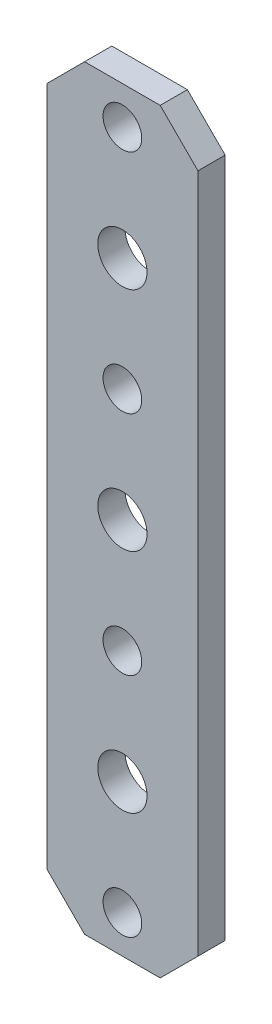
ISO-10303-21;
HEADER;
FILE_DESCRIPTION(('STEP AP214'),'2;1');
FILE_NAME('part.step','',(''),(''),'','','');
FILE_SCHEMA(('AUTOMOTIVE_DESIGN { 1 0 10303 214 1 1 1 1 }'));
ENDSEC;
DATA;
#1=APPLICATION_CONTEXT('core data for automotive mechanical design processes');
#2=APPLICATION_PROTOCOL_DEFINITION('international standard','automotive_design',2000,#1);
#3=PRODUCT_CONTEXT('',#1,'mechanical');
#4=PRODUCT('Part','Part','',(#3));
#5=PRODUCT_RELATED_PRODUCT_CATEGORY('part','',(#4));
#6=PRODUCT_DEFINITION_FORMATION('','',#4);
#7=PRODUCT_DEFINITION_CONTEXT('part definition',#1,'design');
#8=PRODUCT_DEFINITION('design','',#6,#7);
#9=PRODUCT_DEFINITION_SHAPE('','',#8);
#10=(LENGTH_UNIT() NAMED_UNIT(*) SI_UNIT(.MILLI.,.METRE.));
#11=(NAMED_UNIT(*) PLANE_ANGLE_UNIT() SI_UNIT($,.RADIAN.));
#12=(NAMED_UNIT(*) SI_UNIT($,.STERADIAN.) SOLID_ANGLE_UNIT());
#13=UNCERTAINTY_MEASURE_WITH_UNIT(LENGTH_MEASURE(1.E-05),#10,'distance_accuracy_value','');
#14=(GEOMETRIC_REPRESENTATION_CONTEXT(3) GLOBAL_UNCERTAINTY_ASSIGNED_CONTEXT((#13)) GLOBAL_UNIT_ASSIGNED_CONTEXT((#10,
#11,#12)) REPRESENTATION_CONTEXT('',''));
#15=CARTESIAN_POINT('',(0.,0.,0.));
#16=DIRECTION('',(0.,0.,1.));
#17=DIRECTION('',(1.,0.,0.));
#18=AXIS2_PLACEMENT_3D('',#15,#16,#17);
#19=CARTESIAN_POINT('',(-6.35,-31.75,2.286));
#20=DIRECTION('',(0.,0.,1.));
#21=DIRECTION('',(1.,0.,0.));
#22=AXIS2_PLACEMENT_3D('',#19,#20,#21);
#23=PLANE('',#22);
#24=CARTESIAN_POINT('',(0.,28.575,2.286));
#25=DIRECTION('',(0.,0.,-1.));
#26=DIRECTION('',(-1.,0.,0.));
#27=AXIS2_PLACEMENT_3D('',#24,#25,#26);
#28=CIRCLE('',#27,1.6256);
#29=CARTESIAN_POINT('',(-1.6256,28.575,2.286));
#30=VERTEX_POINT('',#29);
#31=EDGE_CURVE('E124',#30,#30,#28,.T.);
#32=ORIENTED_EDGE('',*,*,#31,.T.);
#33=EDGE_LOOP('',(#32));
#34=FACE_BOUND('',#33,.T.);
#35=CARTESIAN_POINT('',(0.,-19.05,2.286));
#36=DIRECTION('',(0.,0.,-1.));
#37=DIRECTION('',(-1.,0.,0.));
#38=AXIS2_PLACEMENT_3D('',#35,#36,#37);
#39=CIRCLE('',#38,2.0701);
#40=CARTESIAN_POINT('',(-2.07009999999999,-19.05,2.286));
#41=VERTEX_POINT('',#40);
#42=EDGE_CURVE('E127',#41,#41,#39,.T.);
#43=ORIENTED_EDGE('',*,*,#42,.T.);
#44=EDGE_LOOP('',(#43));
#45=FACE_BOUND('',#44,.T.);
#46=CARTESIAN_POINT('',(0.,19.05,2.286));
#47=DIRECTION('',(0.,0.,-1.));
#48=DIRECTION('',(-1.,0.,0.));
#49=AXIS2_PLACEMENT_3D('',#46,#47,#48);
#50=CIRCLE('',#49,2.0701);
#51=CARTESIAN_POINT('',(-2.07009999999999,19.05,2.286));
#52=VERTEX_POINT('',#51);
#53=EDGE_CURVE('E130',#52,#52,#50,.T.);
#54=ORIENTED_EDGE('',*,*,#53,.T.);
#55=EDGE_LOOP('',(#54));
#56=FACE_BOUND('',#55,.T.);
#57=CARTESIAN_POINT('',(0.,0.,2.286));
#58=DIRECTION('',(0.,0.,-1.));
#59=DIRECTION('',(-1.,0.,0.));
#60=AXIS2_PLACEMENT_3D('',#57,#58,#59);
#61=CIRCLE('',#60,2.0701);
#62=CARTESIAN_POINT('',(-2.07009999999999,0.,2.286));
#63=VERTEX_POINT('',#62);
#64=EDGE_CURVE('E133',#63,#63,#61,.T.);
#65=ORIENTED_EDGE('',*,*,#64,.T.);
#66=EDGE_LOOP('',(#65));
#67=FACE_BOUND('',#66,.T.);
#68=DIRECTION('',(1.,0.,0.));
#69=VECTOR('',#68,1.);
#70=CARTESIAN_POINT('',(-6.35,31.75,2.286));
#71=LINE('',#70,#69);
#72=CARTESIAN_POINT('',(3.17499999999999,31.75,2.286));
#73=VERTEX_POINT('',#72);
#74=CARTESIAN_POINT('',(-3.175,31.75,2.286));
#75=VERTEX_POINT('',#74);
#76=EDGE_CURVE('E365',#73,#75,#71,.F.);
#77=ORIENTED_EDGE('',*,*,#76,.T.);
#78=DIRECTION('',(0.707106781186547,0.707106781186548,0.));
#79=VECTOR('',#78,1.);
#80=CARTESIAN_POINT('',(-6.35,28.575,2.286));
#81=LINE('',#80,#79);
#82=CARTESIAN_POINT('',(-6.34999999999999,28.575,2.286));
#83=VERTEX_POINT('',#82);
#84=EDGE_CURVE('E360',#75,#83,#81,.F.);
#85=ORIENTED_EDGE('',*,*,#84,.T.);
#86=DIRECTION('',(0.,1.,0.));
#87=VECTOR('',#86,1.);
#88=CARTESIAN_POINT('',(-6.35,31.75,2.286));
#89=LINE('',#88,#87);
#90=CARTESIAN_POINT('',(-6.35,-28.575,2.286));
#91=VERTEX_POINT('',#90);
#92=EDGE_CURVE('E355',#83,#91,#89,.F.);
#93=ORIENTED_EDGE('',*,*,#92,.T.);
#94=DIRECTION('',(-0.707106781186548,0.707106781186547,0.));
#95=VECTOR('',#94,1.);
#96=CARTESIAN_POINT('',(-3.175,-31.75,2.286));
#97=LINE('',#96,#95);
#98=CARTESIAN_POINT('',(-3.175,-31.75,2.286));
#99=VERTEX_POINT('',#98);
#100=EDGE_CURVE('E350',#91,#99,#97,.F.);
#101=ORIENTED_EDGE('',*,*,#100,.T.);
#102=DIRECTION('',(1.,0.,0.));
#103=VECTOR('',#102,1.);
#104=CARTESIAN_POINT('',(-6.35,-31.75,2.286));
#105=LINE('',#104,#103);
#106=CARTESIAN_POINT('',(3.175,-31.75,2.286));
#107=VERTEX_POINT('',#106);
#108=EDGE_CURVE('E85',#99,#107,#105,.T.);
#109=ORIENTED_EDGE('',*,*,#108,.T.);
#110=DIRECTION('',(-0.707106781186548,-0.707106781186547,0.));
#111=VECTOR('',#110,1.);
#112=CARTESIAN_POINT('',(6.35,-28.575,2.286));
#113=LINE('',#112,#111);
#114=CARTESIAN_POINT('',(6.35,-28.575,2.286));
#115=VERTEX_POINT('',#114);
#116=EDGE_CURVE('E83',#107,#115,#113,.F.);
#117=ORIENTED_EDGE('',*,*,#116,.T.);
#118=DIRECTION('',(0.,1.,0.));
#119=VECTOR('',#118,1.);
#120=CARTESIAN_POINT('',(6.35,31.75,2.286));
#121=LINE('',#120,#119);
#122=CARTESIAN_POINT('',(6.35,28.575,2.286));
#123=VERTEX_POINT('',#122);
#124=EDGE_CURVE('E80',#115,#123,#121,.T.);
#125=ORIENTED_EDGE('',*,*,#124,.T.);
#126=DIRECTION('',(0.707106781186548,-0.707106781186548,0.));
#127=VECTOR('',#126,1.);
#128=CARTESIAN_POINT('',(3.175,31.75,2.286));
#129=LINE('',#128,#127);
#130=EDGE_CURVE('E333',#123,#73,#129,.F.);
#131=ORIENTED_EDGE('',*,*,#130,.T.);
#132=EDGE_LOOP('',(#77,#85,#93,#101,#109,#117,#125,#131));
#133=FACE_BOUND('',#132,.T.);
#134=CARTESIAN_POINT('',(0.,9.525,2.286));
#135=DIRECTION('',(0.,0.,-1.));
#136=DIRECTION('',(-1.,0.,0.));
#137=AXIS2_PLACEMENT_3D('',#134,#135,#136);
#138=CIRCLE('',#137,1.6256);
#139=CARTESIAN_POINT('',(-1.62559999999999,9.525,2.286));
#140=VERTEX_POINT('',#139);
#141=EDGE_CURVE('E91',#140,#140,#138,.T.);
#142=ORIENTED_EDGE('',*,*,#141,.T.);
#143=EDGE_LOOP('',(#142));
#144=FACE_BOUND('',#143,.T.);
#145=CARTESIAN_POINT('',(0.,-9.525,2.286));
#146=DIRECTION('',(0.,0.,-1.));
#147=DIRECTION('',(-1.,0.,0.));
#148=AXIS2_PLACEMENT_3D('',#145,#146,#147);
#149=CIRCLE('',#148,1.6256);
#150=CARTESIAN_POINT('',(-1.62559999999999,-9.525,2.286));
#151=VERTEX_POINT('',#150);
#152=EDGE_CURVE('E137',#151,#151,#149,.T.);
#153=ORIENTED_EDGE('',*,*,#152,.T.);
#154=EDGE_LOOP('',(#153));
#155=FACE_BOUND('',#154,.T.);
#156=CARTESIAN_POINT('',(0.,-28.575,2.286));
#157=DIRECTION('',(0.,0.,-1.));
#158=DIRECTION('',(-1.,0.,0.));
#159=AXIS2_PLACEMENT_3D('',#156,#157,#158);
#160=CIRCLE('',#159,1.6256);
#161=CARTESIAN_POINT('',(-1.62559999999999,-28.575,2.286));
#162=VERTEX_POINT('',#161);
#163=EDGE_CURVE('E20',#162,#162,#160,.T.);
#164=ORIENTED_EDGE('',*,*,#163,.T.);
#165=EDGE_LOOP('',(#164));
#166=FACE_BOUND('',#165,.T.);
#167=ADVANCED_FACE('F17',(#34,#45,#56,#67,#133,#144,#155,#166),#23,.T.);
#168=CARTESIAN_POINT('',(0.,-28.575,2.286));
#169=DIRECTION('',(0.,0.,-1.));
#170=DIRECTION('',(-1.,0.,0.));
#171=AXIS2_PLACEMENT_3D('',#168,#169,#170);
#172=CYLINDRICAL_SURFACE('',#171,1.6256);
#173=CARTESIAN_POINT('',(0.,-28.575,0.));
#174=DIRECTION('',(0.,0.,-1.));
#175=DIRECTION('',(-1.,0.,0.));
#176=AXIS2_PLACEMENT_3D('',#173,#174,#175);
#177=CIRCLE('',#176,1.6256);
#178=CARTESIAN_POINT('',(-1.62559999999999,-28.575,0.));
#179=VERTEX_POINT('',#178);
#180=EDGE_CURVE('E121',#179,#179,#177,.T.);
#181=ORIENTED_EDGE('',*,*,#180,.T.);
#182=EDGE_LOOP('',(#181));
#183=FACE_BOUND('',#182,.T.);
#184=ORIENTED_EDGE('',*,*,#163,.F.);
#185=EDGE_LOOP('',(#184));
#186=FACE_BOUND('',#185,.T.);
#187=ADVANCED_FACE('F145',(#183,#186),#172,.F.);
#188=CARTESIAN_POINT('',(0.,-9.525,2.286));
#189=DIRECTION('',(0.,0.,-1.));
#190=DIRECTION('',(-1.,0.,0.));
#191=AXIS2_PLACEMENT_3D('',#188,#189,#190);
#192=CYLINDRICAL_SURFACE('',#191,1.6256);
#193=CARTESIAN_POINT('',(0.,-9.525,0.));
#194=DIRECTION('',(0.,0.,-1.));
#195=DIRECTION('',(-1.,0.,0.));
#196=AXIS2_PLACEMENT_3D('',#193,#194,#195);
#197=CIRCLE('',#196,1.6256);
#198=CARTESIAN_POINT('',(-1.62559999999999,-9.525,0.));
#199=VERTEX_POINT('',#198);
#200=EDGE_CURVE('E118',#199,#199,#197,.T.);
#201=ORIENTED_EDGE('',*,*,#200,.T.);
#202=EDGE_LOOP('',(#201));
#203=FACE_BOUND('',#202,.T.);
#204=ORIENTED_EDGE('',*,*,#152,.F.);
#205=EDGE_LOOP('',(#204));
#206=FACE_BOUND('',#205,.T.);
#207=ADVANCED_FACE('F147',(#203,#206),#192,.F.);
#208=CARTESIAN_POINT('',(0.,9.525,2.286));
#209=DIRECTION('',(0.,0.,-1.));
#210=DIRECTION('',(-1.,0.,0.));
#211=AXIS2_PLACEMENT_3D('',#208,#209,#210);
#212=CYLINDRICAL_SURFACE('',#211,1.6256);
#213=CARTESIAN_POINT('',(0.,9.525,0.));
#214=DIRECTION('',(0.,0.,-1.));
#215=DIRECTION('',(-1.,0.,0.));
#216=AXIS2_PLACEMENT_3D('',#213,#214,#215);
#217=CIRCLE('',#216,1.6256);
#218=CARTESIAN_POINT('',(-1.62559999999999,9.525,0.));
#219=VERTEX_POINT('',#218);
#220=EDGE_CURVE('E115',#219,#219,#217,.T.);
#221=ORIENTED_EDGE('',*,*,#220,.T.);
#222=EDGE_LOOP('',(#221));
#223=FACE_BOUND('',#222,.T.);
#224=ORIENTED_EDGE('',*,*,#141,.F.);
#225=EDGE_LOOP('',(#224));
#226=FACE_BOUND('',#225,.T.);
#227=ADVANCED_FACE('F154',(#223,#226),#212,.F.);
#228=CARTESIAN_POINT('',(6.35,-28.575,2.286));
#229=DIRECTION('',(-0.707106781186547,0.707106781186548,0.));
#230=DIRECTION('',(-0.707106781186548,-0.707106781186547,0.));
#231=AXIS2_PLACEMENT_3D('',#228,#229,#230);
#232=PLANE('',#231);
#233=DIRECTION('',(0.,0.,1.));
#234=VECTOR('',#233,1.);
#235=CARTESIAN_POINT('',(3.175,-31.75,2.286));
#236=LINE('',#235,#234);
#237=CARTESIAN_POINT('',(3.175,-31.75,0.));
#238=VERTEX_POINT('',#237);
#239=EDGE_CURVE('E348',#107,#238,#236,.F.);
#240=ORIENTED_EDGE('',*,*,#239,.T.);
#241=DIRECTION('',(0.707106781186547,0.707106781186548,0.));
#242=VECTOR('',#241,1.);
#243=CARTESIAN_POINT('',(3.175,-31.75,0.));
#244=LINE('',#243,#242);
#245=CARTESIAN_POINT('',(6.35,-28.575,0.));
#246=VERTEX_POINT('',#245);
#247=EDGE_CURVE('E102',#238,#246,#244,.T.);
#248=ORIENTED_EDGE('',*,*,#247,.T.);
#249=DIRECTION('',(0.,0.,1.));
#250=VECTOR('',#249,1.);
#251=CARTESIAN_POINT('',(6.35,-28.575,2.286));
#252=LINE('',#251,#250);
#253=EDGE_CURVE('E90',#246,#115,#252,.T.);
#254=ORIENTED_EDGE('',*,*,#253,.T.);
#255=ORIENTED_EDGE('',*,*,#116,.F.);
#256=EDGE_LOOP('',(#240,#248,#254,#255));
#257=FACE_BOUND('',#256,.T.);
#258=ADVANCED_FACE('F101',(#257),#232,.F.);
#259=CARTESIAN_POINT('',(6.35,31.75,2.286));
#260=DIRECTION('',(-1.,0.,0.));
#261=DIRECTION('',(0.,0.,1.));
#262=AXIS2_PLACEMENT_3D('',#259,#260,#261);
#263=PLANE('',#262);
#264=ORIENTED_EDGE('',*,*,#253,.F.);
#265=DIRECTION('',(0.,1.,0.));
#266=VECTOR('',#265,1.);
#267=CARTESIAN_POINT('',(6.35,-31.75,0.));
#268=LINE('',#267,#266);
#269=CARTESIAN_POINT('',(6.35,28.575,0.));
#270=VERTEX_POINT('',#269);
#271=EDGE_CURVE('E337',#246,#270,#268,.T.);
#272=ORIENTED_EDGE('',*,*,#271,.T.);
#273=DIRECTION('',(0.,0.,1.));
#274=VECTOR('',#273,1.);
#275=CARTESIAN_POINT('',(6.35,28.575,2.286));
#276=LINE('',#275,#274);
#277=EDGE_CURVE('E98',#270,#123,#276,.T.);
#278=ORIENTED_EDGE('',*,*,#277,.T.);
#279=ORIENTED_EDGE('',*,*,#124,.F.);
#280=EDGE_LOOP('',(#264,#272,#278,#279));
#281=FACE_BOUND('',#280,.T.);
#282=ADVANCED_FACE('F95',(#281),#263,.F.);
#283=CARTESIAN_POINT('',(3.175,31.75,2.286));
#284=DIRECTION('',(-0.707106781186548,-0.707106781186548,0.));
#285=DIRECTION('',(0.707106781186548,-0.707106781186548,0.));
#286=AXIS2_PLACEMENT_3D('',#283,#284,#285);
#287=PLANE('',#286);
#288=ORIENTED_EDGE('',*,*,#277,.F.);
#289=DIRECTION('',(-0.707106781186548,0.707106781186547,0.));
#290=VECTOR('',#289,1.);
#291=CARTESIAN_POINT('',(6.35,28.575,0.));
#292=LINE('',#291,#290);
#293=CARTESIAN_POINT('',(3.17499999999999,31.75,0.));
#294=VERTEX_POINT('',#293);
#295=EDGE_CURVE('E332',#270,#294,#292,.T.);
#296=ORIENTED_EDGE('',*,*,#295,.T.);
#297=DIRECTION('',(0.,0.,-1.));
#298=VECTOR('',#297,1.);
#299=CARTESIAN_POINT('',(3.175,31.75,2.286));
#300=LINE('',#299,#298);
#301=EDGE_CURVE('E367',#294,#73,#300,.F.);
#302=ORIENTED_EDGE('',*,*,#301,.T.);
#303=ORIENTED_EDGE('',*,*,#130,.F.);
#304=EDGE_LOOP('',(#288,#296,#302,#303));
#305=FACE_BOUND('',#304,.T.);
#306=ADVANCED_FACE('F201',(#305),#287,.F.);
#307=CARTESIAN_POINT('',(-6.35,31.75,2.286));
#308=DIRECTION('',(0.,-1.,0.));
#309=DIRECTION('',(0.,0.,-1.));
#310=AXIS2_PLACEMENT_3D('',#307,#308,#309);
#311=PLANE('',#310);
#312=ORIENTED_EDGE('',*,*,#301,.F.);
#313=DIRECTION('',(1.,0.,0.));
#314=VECTOR('',#313,1.);
#315=CARTESIAN_POINT('',(-6.35,31.75,0.));
#316=LINE('',#315,#314);
#317=CARTESIAN_POINT('',(-3.175,31.75,0.));
#318=VERTEX_POINT('',#317);
#319=EDGE_CURVE('E340',#294,#318,#316,.F.);
#320=ORIENTED_EDGE('',*,*,#319,.T.);
#321=DIRECTION('',(0.,0.,1.));
#322=VECTOR('',#321,1.);
#323=CARTESIAN_POINT('',(-3.175,31.75,2.286));
#324=LINE('',#323,#322);
#325=EDGE_CURVE('E362',#318,#75,#324,.T.);
#326=ORIENTED_EDGE('',*,*,#325,.T.);
#327=ORIENTED_EDGE('',*,*,#76,.F.);
#328=EDGE_LOOP('',(#312,#320,#326,#327));
#329=FACE_BOUND('',#328,.T.);
#330=ADVANCED_FACE('F197',(#329),#311,.F.);
#331=CARTESIAN_POINT('',(-6.35,28.575,2.286));
#332=DIRECTION('',(0.707106781186548,-0.707106781186547,0.));
#333=DIRECTION('',(0.707106781186547,0.707106781186548,0.));
#334=AXIS2_PLACEMENT_3D('',#331,#332,#333);
#335=PLANE('',#334);
#336=ORIENTED_EDGE('',*,*,#325,.F.);
#337=DIRECTION('',(-0.707106781186548,-0.707106781186547,0.));
#338=VECTOR('',#337,1.);
#339=CARTESIAN_POINT('',(-3.175,31.75,0.));
#340=LINE('',#339,#338);
#341=CARTESIAN_POINT('',(-6.34999999999999,28.575,0.));
#342=VERTEX_POINT('',#341);
#343=EDGE_CURVE('E372',#318,#342,#340,.T.);
#344=ORIENTED_EDGE('',*,*,#343,.T.);
#345=DIRECTION('',(0.,0.,-1.));
#346=VECTOR('',#345,1.);
#347=CARTESIAN_POINT('',(-6.35,28.575,2.286));
#348=LINE('',#347,#346);
#349=EDGE_CURVE('E357',#342,#83,#348,.F.);
#350=ORIENTED_EDGE('',*,*,#349,.T.);
#351=ORIENTED_EDGE('',*,*,#84,.F.);
#352=EDGE_LOOP('',(#336,#344,#350,#351));
#353=FACE_BOUND('',#352,.T.);
#354=ADVANCED_FACE('F193',(#353),#335,.F.);
#355=CARTESIAN_POINT('',(-6.35,31.75,2.286));
#356=DIRECTION('',(1.,0.,0.));
#357=DIRECTION('',(0.,0.,-1.));
#358=AXIS2_PLACEMENT_3D('',#355,#356,#357);
#359=PLANE('',#358);
#360=DIRECTION('',(0.,0.,1.));
#361=VECTOR('',#360,1.);
#362=CARTESIAN_POINT('',(-6.35,-28.575,2.286));
#363=LINE('',#362,#361);
#364=CARTESIAN_POINT('',(-6.35,-28.575,0.));
#365=VERTEX_POINT('',#364);
#366=EDGE_CURVE('E352',#365,#91,#363,.T.);
#367=ORIENTED_EDGE('',*,*,#366,.T.);
#368=ORIENTED_EDGE('',*,*,#92,.F.);
#369=ORIENTED_EDGE('',*,*,#349,.F.);
#370=DIRECTION('',(0.,1.,0.));
#371=VECTOR('',#370,1.);
#372=CARTESIAN_POINT('',(-6.35,-31.75,0.));
#373=LINE('',#372,#371);
#374=EDGE_CURVE('E375',#342,#365,#373,.F.);
#375=ORIENTED_EDGE('',*,*,#374,.T.);
#376=EDGE_LOOP('',(#367,#368,#369,#375));
#377=FACE_BOUND('',#376,.T.);
#378=ADVANCED_FACE('F189',(#377),#359,.F.);
#379=CARTESIAN_POINT('',(-3.175,-31.75,2.286));
#380=DIRECTION('',(0.707106781186547,0.707106781186548,0.));
#381=DIRECTION('',(-0.707106781186548,0.707106781186547,0.));
#382=AXIS2_PLACEMENT_3D('',#379,#380,#381);
#383=PLANE('',#382);
#384=ORIENTED_EDGE('',*,*,#366,.F.);
#385=DIRECTION('',(0.707106781186548,-0.707106781186547,0.));
#386=VECTOR('',#385,1.);
#387=CARTESIAN_POINT('',(-6.35,-28.575,0.));
#388=LINE('',#387,#386);
#389=CARTESIAN_POINT('',(-3.175,-31.75,0.));
#390=VERTEX_POINT('',#389);
#391=EDGE_CURVE('E377',#365,#390,#388,.T.);
#392=ORIENTED_EDGE('',*,*,#391,.T.);
#393=DIRECTION('',(0.,0.,1.));
#394=VECTOR('',#393,1.);
#395=CARTESIAN_POINT('',(-3.175,-31.75,2.286));
#396=LINE('',#395,#394);
#397=EDGE_CURVE('E35',#390,#99,#396,.T.);
#398=ORIENTED_EDGE('',*,*,#397,.T.);
#399=ORIENTED_EDGE('',*,*,#100,.F.);
#400=EDGE_LOOP('',(#384,#392,#398,#399));
#401=FACE_BOUND('',#400,.T.);
#402=ADVANCED_FACE('F186',(#401),#383,.F.);
#403=CARTESIAN_POINT('',(-6.35,-31.75,2.286));
#404=DIRECTION('',(0.,1.,0.));
#405=DIRECTION('',(0.,0.,1.));
#406=AXIS2_PLACEMENT_3D('',#403,#404,#405);
#407=PLANE('',#406);
#408=ORIENTED_EDGE('',*,*,#397,.F.);
#409=DIRECTION('',(1.,0.,0.));
#410=VECTOR('',#409,1.);
#411=CARTESIAN_POINT('',(-6.35,-31.75,0.));
#412=LINE('',#411,#410);
#413=EDGE_CURVE('E114',#390,#238,#412,.T.);
#414=ORIENTED_EDGE('',*,*,#413,.T.);
#415=ORIENTED_EDGE('',*,*,#239,.F.);
#416=ORIENTED_EDGE('',*,*,#108,.F.);
#417=EDGE_LOOP('',(#408,#414,#415,#416));
#418=FACE_BOUND('',#417,.T.);
#419=ADVANCED_FACE('F182',(#418),#407,.F.);
#420=CARTESIAN_POINT('',(0.,0.,2.286));
#421=DIRECTION('',(0.,0.,-1.));
#422=DIRECTION('',(-1.,0.,0.));
#423=AXIS2_PLACEMENT_3D('',#420,#421,#422);
#424=CYLINDRICAL_SURFACE('',#423,2.0701);
#425=CARTESIAN_POINT('',(0.,0.,0.));
#426=DIRECTION('',(0.,0.,-1.));
#427=DIRECTION('',(-1.,0.,0.));
#428=AXIS2_PLACEMENT_3D('',#425,#426,#427);
#429=CIRCLE('',#428,2.0701);
#430=CARTESIAN_POINT('',(-2.07009999999999,0.,0.));
#431=VERTEX_POINT('',#430);
#432=EDGE_CURVE('E111',#431,#431,#429,.T.);
#433=ORIENTED_EDGE('',*,*,#432,.T.);
#434=EDGE_LOOP('',(#433));
#435=FACE_BOUND('',#434,.T.);
#436=ORIENTED_EDGE('',*,*,#64,.F.);
#437=EDGE_LOOP('',(#436));
#438=FACE_BOUND('',#437,.T.);
#439=ADVANCED_FACE('F178',(#435,#438),#424,.F.);
#440=CARTESIAN_POINT('',(0.,19.05,2.286));
#441=DIRECTION('',(0.,0.,-1.));
#442=DIRECTION('',(-1.,0.,0.));
#443=AXIS2_PLACEMENT_3D('',#440,#441,#442);
#444=CYLINDRICAL_SURFACE('',#443,2.0701);
#445=CARTESIAN_POINT('',(0.,19.05,0.));
#446=DIRECTION('',(0.,0.,-1.));
#447=DIRECTION('',(-1.,0.,0.));
#448=AXIS2_PLACEMENT_3D('',#445,#446,#447);
#449=CIRCLE('',#448,2.0701);
#450=CARTESIAN_POINT('',(-2.07009999999999,19.05,0.));
#451=VERTEX_POINT('',#450);
#452=EDGE_CURVE('E108',#451,#451,#449,.T.);
#453=ORIENTED_EDGE('',*,*,#452,.T.);
#454=EDGE_LOOP('',(#453));
#455=FACE_BOUND('',#454,.T.);
#456=ORIENTED_EDGE('',*,*,#53,.F.);
#457=EDGE_LOOP('',(#456));
#458=FACE_BOUND('',#457,.T.);
#459=ADVANCED_FACE('F174',(#455,#458),#444,.F.);
#460=CARTESIAN_POINT('',(0.,-19.05,2.286));
#461=DIRECTION('',(0.,0.,-1.));
#462=DIRECTION('',(-1.,0.,0.));
#463=AXIS2_PLACEMENT_3D('',#460,#461,#462);
#464=CYLINDRICAL_SURFACE('',#463,2.0701);
#465=CARTESIAN_POINT('',(0.,-19.05,0.));
#466=DIRECTION('',(0.,0.,-1.));
#467=DIRECTION('',(-1.,0.,0.));
#468=AXIS2_PLACEMENT_3D('',#465,#466,#467);
#469=CIRCLE('',#468,2.0701);
#470=CARTESIAN_POINT('',(-2.07009999999999,-19.05,0.));
#471=VERTEX_POINT('',#470);
#472=EDGE_CURVE('E26',#471,#471,#469,.T.);
#473=ORIENTED_EDGE('',*,*,#472,.T.);
#474=EDGE_LOOP('',(#473));
#475=FACE_BOUND('',#474,.T.);
#476=ORIENTED_EDGE('',*,*,#42,.F.);
#477=EDGE_LOOP('',(#476));
#478=FACE_BOUND('',#477,.T.);
#479=ADVANCED_FACE('F166',(#475,#478),#464,.F.);
#480=CARTESIAN_POINT('',(0.,28.575,2.286));
#481=DIRECTION('',(0.,0.,-1.));
#482=DIRECTION('',(-1.,0.,0.));
#483=AXIS2_PLACEMENT_3D('',#480,#481,#482);
#484=CYLINDRICAL_SURFACE('',#483,1.6256);
#485=CARTESIAN_POINT('',(0.,28.575,0.));
#486=DIRECTION('',(0.,0.,-1.));
#487=DIRECTION('',(-1.,0.,0.));
#488=AXIS2_PLACEMENT_3D('',#485,#486,#487);
#489=CIRCLE('',#488,1.6256);
#490=CARTESIAN_POINT('',(-1.6256,28.575,0.));
#491=VERTEX_POINT('',#490);
#492=EDGE_CURVE('E10',#491,#491,#489,.T.);
#493=ORIENTED_EDGE('',*,*,#492,.T.);
#494=EDGE_LOOP('',(#493));
#495=FACE_BOUND('',#494,.T.);
#496=ORIENTED_EDGE('',*,*,#31,.F.);
#497=EDGE_LOOP('',(#496));
#498=FACE_BOUND('',#497,.T.);
#499=ADVANCED_FACE('F160',(#495,#498),#484,.F.);
#500=CARTESIAN_POINT('',(-6.35,-31.75,0.));
#501=DIRECTION('',(0.,0.,1.));
#502=DIRECTION('',(1.,0.,0.));
#503=AXIS2_PLACEMENT_3D('',#500,#501,#502);
#504=PLANE('',#503);
#505=ORIENTED_EDGE('',*,*,#492,.F.);
#506=EDGE_LOOP('',(#505));
#507=FACE_BOUND('',#506,.T.);
#508=ORIENTED_EDGE('',*,*,#472,.F.);
#509=EDGE_LOOP('',(#508));
#510=FACE_BOUND('',#509,.T.);
#511=ORIENTED_EDGE('',*,*,#452,.F.);
#512=EDGE_LOOP('',(#511));
#513=FACE_BOUND('',#512,.T.);
#514=ORIENTED_EDGE('',*,*,#432,.F.);
#515=EDGE_LOOP('',(#514));
#516=FACE_BOUND('',#515,.T.);
#517=ORIENTED_EDGE('',*,*,#391,.F.);
#518=ORIENTED_EDGE('',*,*,#374,.F.);
#519=ORIENTED_EDGE('',*,*,#343,.F.);
#520=ORIENTED_EDGE('',*,*,#319,.F.);
#521=ORIENTED_EDGE('',*,*,#295,.F.);
#522=ORIENTED_EDGE('',*,*,#271,.F.);
#523=ORIENTED_EDGE('',*,*,#247,.F.);
#524=ORIENTED_EDGE('',*,*,#413,.F.);
#525=EDGE_LOOP('',(#517,#518,#519,#520,#521,#522,#523,#524));
#526=FACE_BOUND('',#525,.T.);
#527=ORIENTED_EDGE('',*,*,#220,.F.);
#528=EDGE_LOOP('',(#527));
#529=FACE_BOUND('',#528,.T.);
#530=ORIENTED_EDGE('',*,*,#200,.F.);
#531=EDGE_LOOP('',(#530));
#532=FACE_BOUND('',#531,.T.);
#533=ORIENTED_EDGE('',*,*,#180,.F.);
#534=EDGE_LOOP('',(#533));
#535=FACE_BOUND('',#534,.T.);
#536=ADVANCED_FACE('F158',(#507,#510,#513,#516,#526,#529,#532,#535),#504,.F.);
#537=CLOSED_SHELL('',(#167,#187,#207,#227,#258,#282,#306,#330,#354,#378,#402,#419,#439,#459,
#479,#499,#536));
#538=MANIFOLD_SOLID_BREP('B1',#537);
#539=ADVANCED_BREP_SHAPE_REPRESENTATION('',(#18,#538),#14);
#540=SHAPE_DEFINITION_REPRESENTATION(#9,#539);
ENDSEC;
END-ISO-10303-21;
